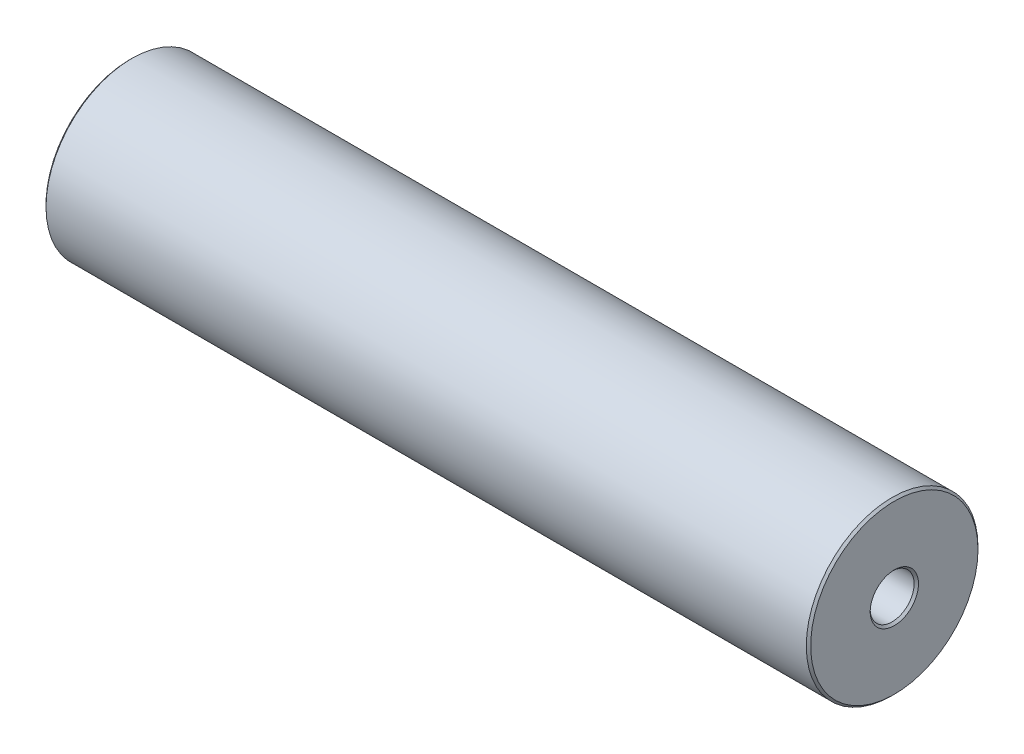
ISO-10303-21;
HEADER;
FILE_DESCRIPTION(('STEP AP214'),'2;1');
FILE_NAME('part.step','',(''),(''),'','','');
FILE_SCHEMA(('AUTOMOTIVE_DESIGN { 1 0 10303 214 1 1 1 1 }'));
ENDSEC;
DATA;
#1=APPLICATION_CONTEXT('core data for automotive mechanical design processes');
#2=APPLICATION_PROTOCOL_DEFINITION('international standard','automotive_design',2000,#1);
#3=PRODUCT_CONTEXT('',#1,'mechanical');
#4=PRODUCT('Part','Part','',(#3));
#5=PRODUCT_RELATED_PRODUCT_CATEGORY('part','',(#4));
#6=PRODUCT_DEFINITION_FORMATION('','',#4);
#7=PRODUCT_DEFINITION_CONTEXT('part definition',#1,'design');
#8=PRODUCT_DEFINITION('design','',#6,#7);
#9=PRODUCT_DEFINITION_SHAPE('','',#8);
#10=(LENGTH_UNIT() NAMED_UNIT(*) SI_UNIT(.MILLI.,.METRE.));
#11=(NAMED_UNIT(*) PLANE_ANGLE_UNIT() SI_UNIT($,.RADIAN.));
#12=(NAMED_UNIT(*) SI_UNIT($,.STERADIAN.) SOLID_ANGLE_UNIT());
#13=UNCERTAINTY_MEASURE_WITH_UNIT(LENGTH_MEASURE(1.E-05),#10,'distance_accuracy_value','');
#14=(GEOMETRIC_REPRESENTATION_CONTEXT(3) GLOBAL_UNCERTAINTY_ASSIGNED_CONTEXT((#13)) GLOBAL_UNIT_ASSIGNED_CONTEXT((#10,
#11,#12)) REPRESENTATION_CONTEXT('',''));
#15=CARTESIAN_POINT('',(0.,0.,0.));
#16=DIRECTION('',(0.,0.,1.));
#17=DIRECTION('',(1.,0.,0.));
#18=AXIS2_PLACEMENT_3D('',#15,#16,#17);
#19=CARTESIAN_POINT('',(44.45,0.,0.));
#20=DIRECTION('',(-1.,0.,0.));
#21=DIRECTION('',(0.,0.,1.));
#22=AXIS2_PLACEMENT_3D('',#19,#20,#21);
#23=CYLINDRICAL_SURFACE('',#22,9.980949939);
#24=CARTESIAN_POINT('',(44.196,0.,0.));
#25=DIRECTION('',(1.,0.,0.));
#26=DIRECTION('',(0.,0.,-1.));
#27=AXIS2_PLACEMENT_3D('',#24,#25,#26);
#28=CIRCLE('',#27,9.980949939);
#29=CARTESIAN_POINT('',(44.196,0.,-9.980949939));
#30=VERTEX_POINT('',#29);
#31=EDGE_CURVE('E82',#30,#30,#28,.F.);
#32=ORIENTED_EDGE('',*,*,#31,.T.);
#33=EDGE_LOOP('',(#32));
#34=FACE_BOUND('',#33,.T.);
#35=CARTESIAN_POINT('',(-44.196,0.,0.));
#36=DIRECTION('',(1.,0.,0.));
#37=DIRECTION('',(0.,0.,-1.));
#38=AXIS2_PLACEMENT_3D('',#35,#36,#37);
#39=CIRCLE('',#38,9.980949939);
#40=CARTESIAN_POINT('',(-44.196,0.,-9.980949939));
#41=VERTEX_POINT('',#40);
#42=EDGE_CURVE('E79',#41,#41,#39,.T.);
#43=ORIENTED_EDGE('',*,*,#42,.T.);
#44=EDGE_LOOP('',(#43));
#45=FACE_BOUND('',#44,.T.);
#46=ADVANCED_FACE('F43',(#34,#45),#23,.T.);
#47=CARTESIAN_POINT('',(44.45,0.,0.));
#48=DIRECTION('',(1.,0.,0.));
#49=DIRECTION('',(0.,0.,-1.));
#50=AXIS2_PLACEMENT_3D('',#47,#48,#49);
#51=PLANE('',#50);
#52=CARTESIAN_POINT('',(44.45,0.,0.));
#53=DIRECTION('',(1.,0.,0.));
#54=DIRECTION('',(0.,0.,-1.));
#55=AXIS2_PLACEMENT_3D('',#52,#53,#54);
#56=CIRCLE('',#55,9.72694993899999);
#57=CARTESIAN_POINT('',(44.45,0.,-9.72694993899999));
#58=VERTEX_POINT('',#57);
#59=EDGE_CURVE('E76',#58,#58,#56,.T.);
#60=ORIENTED_EDGE('',*,*,#59,.T.);
#61=EDGE_LOOP('',(#60));
#62=FACE_BOUND('',#61,.T.);
#63=CARTESIAN_POINT('',(44.45,0.,0.));
#64=DIRECTION('',(1.,0.,0.));
#65=DIRECTION('',(0.,0.,-1.));
#66=AXIS2_PLACEMENT_3D('',#63,#64,#65);
#67=CIRCLE('',#66,2.8067);
#68=CARTESIAN_POINT('',(44.45,0.,-2.8067));
#69=VERTEX_POINT('',#68);
#70=EDGE_CURVE('E71',#69,#69,#67,.F.);
#71=ORIENTED_EDGE('',*,*,#70,.T.);
#72=EDGE_LOOP('',(#71));
#73=FACE_BOUND('',#72,.T.);
#74=ADVANCED_FACE('F103',(#62,#73),#51,.T.);
#75=CARTESIAN_POINT('',(-44.45,0.,0.));
#76=DIRECTION('',(1.,0.,0.));
#77=DIRECTION('',(0.,0.,-1.));
#78=AXIS2_PLACEMENT_3D('',#75,#76,#77);
#79=PLANE('',#78);
#80=CARTESIAN_POINT('',(-44.45,0.,0.));
#81=DIRECTION('',(1.,0.,0.));
#82=DIRECTION('',(0.,0.,-1.));
#83=AXIS2_PLACEMENT_3D('',#80,#81,#82);
#84=CIRCLE('',#83,9.72694993900003);
#85=CARTESIAN_POINT('',(-44.45,0.,-9.72694993900003));
#86=VERTEX_POINT('',#85);
#87=EDGE_CURVE('E52',#86,#86,#84,.F.);
#88=ORIENTED_EDGE('',*,*,#87,.T.);
#89=EDGE_LOOP('',(#88));
#90=FACE_BOUND('',#89,.T.);
#91=CARTESIAN_POINT('',(-44.45,0.,0.));
#92=DIRECTION('',(1.,0.,0.));
#93=DIRECTION('',(0.,0.,-1.));
#94=AXIS2_PLACEMENT_3D('',#91,#92,#93);
#95=CIRCLE('',#94,2.8067);
#96=CARTESIAN_POINT('',(-44.45,0.,-2.8067));
#97=VERTEX_POINT('',#96);
#98=EDGE_CURVE('E88',#97,#97,#95,.T.);
#99=ORIENTED_EDGE('',*,*,#98,.T.);
#100=EDGE_LOOP('',(#99));
#101=FACE_BOUND('',#100,.T.);
#102=ADVANCED_FACE('F93',(#90,#101),#79,.F.);
#103=CARTESIAN_POINT('',(-27.94,0.,0.));
#104=DIRECTION('',(-1.,0.,0.));
#105=DIRECTION('',(0.,0.,1.));
#106=AXIS2_PLACEMENT_3D('',#103,#104,#105);
#107=CONICAL_SURFACE('',#106,2.5527,1.02974425867665);
#108=CARTESIAN_POINT('',(-26.4061830978083,0.,0.));
#109=VERTEX_POINT('',#108);
#110=VERTEX_LOOP('',#109);
#111=FACE_BOUND('',#110,.T.);
#112=CARTESIAN_POINT('',(-27.94,0.,0.));
#113=DIRECTION('',(-1.,0.,0.));
#114=DIRECTION('',(0.,0.,1.));
#115=AXIS2_PLACEMENT_3D('',#112,#113,#114);
#116=CIRCLE('',#115,2.5527);
#117=CARTESIAN_POINT('',(-27.94,0.,2.5527));
#118=VERTEX_POINT('',#117);
#119=EDGE_CURVE('E68',#118,#118,#116,.T.);
#120=ORIENTED_EDGE('',*,*,#119,.T.);
#121=EDGE_LOOP('',(#120));
#122=FACE_BOUND('',#121,.T.);
#123=ADVANCED_FACE('F143',(#111,#122),#107,.F.);
#124=CARTESIAN_POINT('',(-44.45,0.,0.));
#125=DIRECTION('',(-1.,0.,0.));
#126=DIRECTION('',(0.,0.,1.));
#127=AXIS2_PLACEMENT_3D('',#124,#125,#126);
#128=CYLINDRICAL_SURFACE('',#127,2.5527);
#129=CARTESIAN_POINT('',(-44.196,0.,0.));
#130=DIRECTION('',(1.,0.,0.));
#131=DIRECTION('',(0.,0.,-1.));
#132=AXIS2_PLACEMENT_3D('',#129,#130,#131);
#133=CIRCLE('',#132,2.5527);
#134=CARTESIAN_POINT('',(-44.196,0.,-2.5527));
#135=VERTEX_POINT('',#134);
#136=EDGE_CURVE('E11',#135,#135,#133,.F.);
#137=ORIENTED_EDGE('',*,*,#136,.T.);
#138=EDGE_LOOP('',(#137));
#139=FACE_BOUND('',#138,.T.);
#140=ORIENTED_EDGE('',*,*,#119,.F.);
#141=EDGE_LOOP('',(#140));
#142=FACE_BOUND('',#141,.T.);
#143=ADVANCED_FACE('F62',(#139,#142),#128,.F.);
#144=CARTESIAN_POINT('',(27.94,0.,0.));
#145=DIRECTION('',(1.,0.,0.));
#146=DIRECTION('',(0.,0.,-1.));
#147=AXIS2_PLACEMENT_3D('',#144,#145,#146);
#148=CONICAL_SURFACE('',#147,2.5527,1.02974425867665);
#149=CARTESIAN_POINT('',(26.4061830978083,0.,0.));
#150=VERTEX_POINT('',#149);
#151=VERTEX_LOOP('',#150);
#152=FACE_BOUND('',#151,.T.);
#153=CARTESIAN_POINT('',(27.94,0.,0.));
#154=DIRECTION('',(1.,0.,0.));
#155=DIRECTION('',(0.,0.,-1.));
#156=AXIS2_PLACEMENT_3D('',#153,#154,#155);
#157=CIRCLE('',#156,2.5527);
#158=CARTESIAN_POINT('',(27.94,0.,-2.5527));
#159=VERTEX_POINT('',#158);
#160=EDGE_CURVE('E66',#159,#159,#157,.T.);
#161=ORIENTED_EDGE('',*,*,#160,.T.);
#162=EDGE_LOOP('',(#161));
#163=FACE_BOUND('',#162,.T.);
#164=ADVANCED_FACE('F58',(#152,#163),#148,.F.);
#165=CARTESIAN_POINT('',(44.45,0.,0.));
#166=DIRECTION('',(1.,0.,0.));
#167=DIRECTION('',(0.,0.,-1.));
#168=AXIS2_PLACEMENT_3D('',#165,#166,#167);
#169=CYLINDRICAL_SURFACE('',#168,2.5527);
#170=CARTESIAN_POINT('',(44.196,0.,0.));
#171=DIRECTION('',(1.,0.,0.));
#172=DIRECTION('',(0.,0.,-1.));
#173=AXIS2_PLACEMENT_3D('',#170,#171,#172);
#174=CIRCLE('',#173,2.5527);
#175=CARTESIAN_POINT('',(44.196,0.,-2.5527));
#176=VERTEX_POINT('',#175);
#177=EDGE_CURVE('E85',#176,#176,#174,.T.);
#178=ORIENTED_EDGE('',*,*,#177,.T.);
#179=EDGE_LOOP('',(#178));
#180=FACE_BOUND('',#179,.T.);
#181=ORIENTED_EDGE('',*,*,#160,.F.);
#182=EDGE_LOOP('',(#181));
#183=FACE_BOUND('',#182,.T.);
#184=ADVANCED_FACE('F61',(#180,#183),#169,.F.);
#185=CARTESIAN_POINT('',(44.45,0.,0.));
#186=DIRECTION('',(-1.,0.,0.));
#187=DIRECTION('',(0.,0.,1.));
#188=AXIS2_PLACEMENT_3D('',#185,#186,#187);
#189=CONICAL_SURFACE('',#188,9.72694993899999,0.785398163397438);
#190=ORIENTED_EDGE('',*,*,#31,.F.);
#191=EDGE_LOOP('',(#190));
#192=FACE_BOUND('',#191,.T.);
#193=ORIENTED_EDGE('',*,*,#59,.F.);
#194=EDGE_LOOP('',(#193));
#195=FACE_BOUND('',#194,.T.);
#196=ADVANCED_FACE('F114',(#192,#195),#189,.T.);
#197=CARTESIAN_POINT('',(44.196,0.,0.));
#198=DIRECTION('',(1.,0.,0.));
#199=DIRECTION('',(0.,0.,-1.));
#200=AXIS2_PLACEMENT_3D('',#197,#198,#199);
#201=CONICAL_SURFACE('',#200,2.5527,0.785398163397462);
#202=ORIENTED_EDGE('',*,*,#70,.F.);
#203=EDGE_LOOP('',(#202));
#204=FACE_BOUND('',#203,.T.);
#205=ORIENTED_EDGE('',*,*,#177,.F.);
#206=EDGE_LOOP('',(#205));
#207=FACE_BOUND('',#206,.T.);
#208=ADVANCED_FACE('F99',(#204,#207),#201,.F.);
#209=CARTESIAN_POINT('',(-44.196,0.,0.));
#210=DIRECTION('',(1.,0.,0.));
#211=DIRECTION('',(0.,0.,-1.));
#212=AXIS2_PLACEMENT_3D('',#209,#210,#211);
#213=CONICAL_SURFACE('',#212,9.980949939,0.785398163397438);
#214=ORIENTED_EDGE('',*,*,#87,.F.);
#215=EDGE_LOOP('',(#214));
#216=FACE_BOUND('',#215,.T.);
#217=ORIENTED_EDGE('',*,*,#42,.F.);
#218=EDGE_LOOP('',(#217));
#219=FACE_BOUND('',#218,.T.);
#220=ADVANCED_FACE('F96',(#216,#219),#213,.T.);
#221=CARTESIAN_POINT('',(-44.196,0.,0.));
#222=DIRECTION('',(-1.,0.,0.));
#223=DIRECTION('',(0.,0.,1.));
#224=AXIS2_PLACEMENT_3D('',#221,#222,#223);
#225=CONICAL_SURFACE('',#224,2.5527,0.785398163397462);
#226=ORIENTED_EDGE('',*,*,#98,.F.);
#227=EDGE_LOOP('',(#226));
#228=FACE_BOUND('',#227,.T.);
#229=ORIENTED_EDGE('',*,*,#136,.F.);
#230=EDGE_LOOP('',(#229));
#231=FACE_BOUND('',#230,.T.);
#232=ADVANCED_FACE('F46',(#228,#231),#225,.F.);
#233=CLOSED_SHELL('',(#46,#74,#102,#123,#143,#164,#184,#196,#208,#220,#232));
#234=MANIFOLD_SOLID_BREP('B2',#233);
#235=ADVANCED_BREP_SHAPE_REPRESENTATION('',(#18,#234),#14);
#236=SHAPE_DEFINITION_REPRESENTATION(#9,#235);
ENDSEC;
END-ISO-10303-21;
